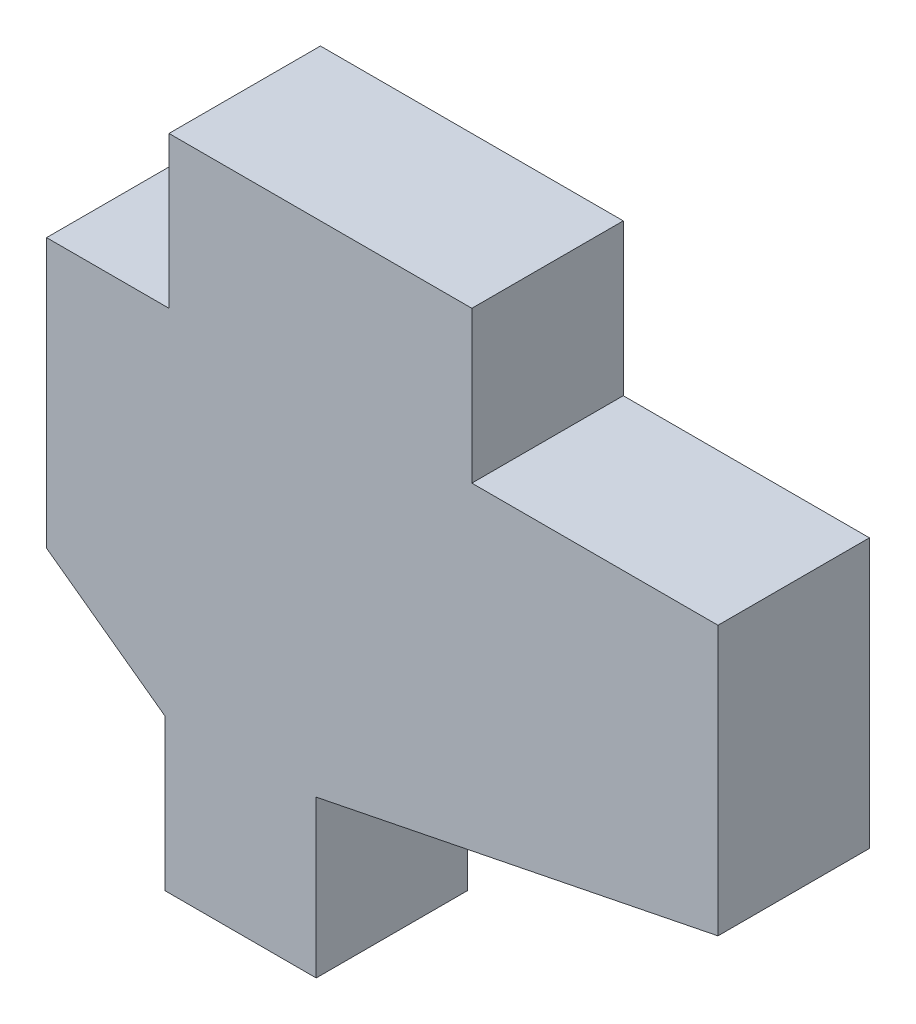
ISO-10303-21;
HEADER;
FILE_DESCRIPTION(('STEP AP214'),'2;1');
FILE_NAME('part.step','',(''),(''),'','','');
FILE_SCHEMA(('AUTOMOTIVE_DESIGN { 1 0 10303 214 1 1 1 1 }'));
ENDSEC;
DATA;
#1=APPLICATION_CONTEXT('core data for automotive mechanical design processes');
#2=APPLICATION_PROTOCOL_DEFINITION('international standard','automotive_design',2000,#1);
#3=PRODUCT_CONTEXT('',#1,'mechanical');
#4=PRODUCT('Part','Part','',(#3));
#5=PRODUCT_RELATED_PRODUCT_CATEGORY('part','',(#4));
#6=PRODUCT_DEFINITION_FORMATION('','',#4);
#7=PRODUCT_DEFINITION_CONTEXT('part definition',#1,'design');
#8=PRODUCT_DEFINITION('design','',#6,#7);
#9=PRODUCT_DEFINITION_SHAPE('','',#8);
#10=(LENGTH_UNIT() NAMED_UNIT(*) SI_UNIT(.MILLI.,.METRE.));
#11=(NAMED_UNIT(*) PLANE_ANGLE_UNIT() SI_UNIT($,.RADIAN.));
#12=(NAMED_UNIT(*) SI_UNIT($,.STERADIAN.) SOLID_ANGLE_UNIT());
#13=UNCERTAINTY_MEASURE_WITH_UNIT(LENGTH_MEASURE(1.E-05),#10,'distance_accuracy_value','');
#14=(GEOMETRIC_REPRESENTATION_CONTEXT(3) GLOBAL_UNCERTAINTY_ASSIGNED_CONTEXT((#13)) GLOBAL_UNIT_ASSIGNED_CONTEXT((#10,
#11,#12)) REPRESENTATION_CONTEXT('',''));
#15=CARTESIAN_POINT('',(0.,0.,0.));
#16=DIRECTION('',(0.,0.,1.));
#17=DIRECTION('',(1.,0.,0.));
#18=AXIS2_PLACEMENT_3D('',#15,#16,#17);
#19=CARTESIAN_POINT('',(-75.1467412259888,-1.524,1.524));
#20=DIRECTION('',(0.,-1.,0.));
#21=DIRECTION('',(0.,0.,-1.));
#22=AXIS2_PLACEMENT_3D('',#19,#20,#21);
#23=PLANE('',#22);
#24=DIRECTION('',(-1.,0.,0.));
#25=VECTOR('',#24,1.);
#26=CARTESIAN_POINT('',(-75.1467412259888,-1.524,0.));
#27=LINE('',#26,#25);
#28=CARTESIAN_POINT('',(-75.1467412259888,-1.524,0.));
#29=VERTEX_POINT('',#28);
#30=CARTESIAN_POINT('',(-76.378564210632,-1.524,0.));
#31=VERTEX_POINT('',#30);
#32=EDGE_CURVE('E152',#29,#31,#27,.T.);
#33=ORIENTED_EDGE('',*,*,#32,.T.);
#34=DIRECTION('',(0.,0.,-1.));
#35=VECTOR('',#34,1.);
#36=CARTESIAN_POINT('',(-76.378564210632,-1.524,1.524));
#37=LINE('',#36,#35);
#38=CARTESIAN_POINT('',(-76.378564210632,-1.524,1.524));
#39=VERTEX_POINT('',#38);
#40=EDGE_CURVE('E11',#39,#31,#37,.T.);
#41=ORIENTED_EDGE('',*,*,#40,.F.);
#42=DIRECTION('',(-1.,0.,0.));
#43=VECTOR('',#42,1.);
#44=CARTESIAN_POINT('',(-75.1467412259888,-1.524,1.524));
#45=LINE('',#44,#43);
#46=CARTESIAN_POINT('',(-75.1467412259888,-1.524,1.524));
#47=VERTEX_POINT('',#46);
#48=EDGE_CURVE('E174',#47,#39,#45,.T.);
#49=ORIENTED_EDGE('',*,*,#48,.F.);
#50=DIRECTION('',(0.,0.,-1.));
#51=VECTOR('',#50,1.);
#52=CARTESIAN_POINT('',(-75.1467412259888,-1.524,1.524));
#53=LINE('',#52,#51);
#54=EDGE_CURVE('E148',#47,#29,#53,.T.);
#55=ORIENTED_EDGE('',*,*,#54,.T.);
#56=EDGE_LOOP('',(#33,#41,#49,#55));
#57=FACE_BOUND('',#56,.T.);
#58=ADVANCED_FACE('F32',(#57),#23,.F.);
#59=CARTESIAN_POINT('',(-76.378564210632,-1.524,1.524));
#60=DIRECTION('',(1.,0.,0.));
#61=DIRECTION('',(0.,0.,-1.));
#62=AXIS2_PLACEMENT_3D('',#59,#60,#61);
#63=PLANE('',#62);
#64=DIRECTION('',(0.,-1.,0.));
#65=VECTOR('',#64,1.);
#66=CARTESIAN_POINT('',(-76.378564210632,-1.524,0.));
#67=LINE('',#66,#65);
#68=CARTESIAN_POINT('',(-76.378564210632,-4.23137284195718,0.));
#69=VERTEX_POINT('',#68);
#70=EDGE_CURVE('E155',#31,#69,#67,.T.);
#71=ORIENTED_EDGE('',*,*,#70,.T.);
#72=DIRECTION('',(0.,0.,-1.));
#73=VECTOR('',#72,1.);
#74=CARTESIAN_POINT('',(-76.378564210632,-4.23137284195718,1.524));
#75=LINE('',#74,#73);
#76=CARTESIAN_POINT('',(-76.378564210632,-4.23137284195718,1.524));
#77=VERTEX_POINT('',#76);
#78=EDGE_CURVE('E40',#77,#69,#75,.T.);
#79=ORIENTED_EDGE('',*,*,#78,.F.);
#80=DIRECTION('',(0.,-1.,0.));
#81=VECTOR('',#80,1.);
#82=CARTESIAN_POINT('',(-76.378564210632,-1.524,1.524));
#83=LINE('',#82,#81);
#84=EDGE_CURVE('E103',#39,#77,#83,.T.);
#85=ORIENTED_EDGE('',*,*,#84,.F.);
#86=ORIENTED_EDGE('',*,*,#40,.T.);
#87=EDGE_LOOP('',(#71,#79,#85,#86));
#88=FACE_BOUND('',#87,.T.);
#89=ADVANCED_FACE('F252',(#88),#63,.F.);
#90=CARTESIAN_POINT('',(-76.378564210632,-4.23137284195718,1.524));
#91=DIRECTION('',(0.588188005844227,0.808724223565111,0.));
#92=DIRECTION('',(-0.808724223565111,0.588188005844227,0.));
#93=AXIS2_PLACEMENT_3D('',#90,#91,#92);
#94=PLANE('',#93);
#95=DIRECTION('',(0.808724223565111,-0.588188005844227,0.));
#96=VECTOR('',#95,1.);
#97=CARTESIAN_POINT('',(-76.378564210632,-4.23137284195718,0.));
#98=LINE('',#97,#96);
#99=CARTESIAN_POINT('',(-75.1892370237555,-5.09637473748769,0.));
#100=VERTEX_POINT('',#99);
#101=EDGE_CURVE('E157',#69,#100,#98,.T.);
#102=ORIENTED_EDGE('',*,*,#101,.T.);
#103=DIRECTION('',(0.,0.,-1.));
#104=VECTOR('',#103,1.);
#105=CARTESIAN_POINT('',(-75.1892370237555,-5.09637473748769,1.524));
#106=LINE('',#105,#104);
#107=CARTESIAN_POINT('',(-75.1892370237555,-5.09637473748769,1.524));
#108=VERTEX_POINT('',#107);
#109=EDGE_CURVE('E193',#108,#100,#106,.T.);
#110=ORIENTED_EDGE('',*,*,#109,.F.);
#111=DIRECTION('',(0.808724223565111,-0.588188005844227,0.));
#112=VECTOR('',#111,1.);
#113=CARTESIAN_POINT('',(-76.378564210632,-4.23137284195718,1.524));
#114=LINE('',#113,#112);
#115=EDGE_CURVE('E201',#77,#108,#114,.T.);
#116=ORIENTED_EDGE('',*,*,#115,.F.);
#117=ORIENTED_EDGE('',*,*,#78,.T.);
#118=EDGE_LOOP('',(#102,#110,#116,#117));
#119=FACE_BOUND('',#118,.T.);
#120=ADVANCED_FACE('F199',(#119),#94,.F.);
#121=CARTESIAN_POINT('',(-75.1892370237555,-5.09637473748769,1.524));
#122=DIRECTION('',(1.,0.,0.));
#123=DIRECTION('',(0.,0.,-1.));
#124=AXIS2_PLACEMENT_3D('',#121,#122,#123);
#125=PLANE('',#124);
#126=DIRECTION('',(0.,-1.,0.));
#127=VECTOR('',#126,1.);
#128=CARTESIAN_POINT('',(-75.1892370237555,-5.09637473748769,0.));
#129=LINE('',#128,#127);
#130=CARTESIAN_POINT('',(-75.1892370237555,-6.62037473748769,0.));
#131=VERTEX_POINT('',#130);
#132=EDGE_CURVE('E159',#100,#131,#129,.T.);
#133=ORIENTED_EDGE('',*,*,#132,.T.);
#134=DIRECTION('',(0.,0.,-1.));
#135=VECTOR('',#134,1.);
#136=CARTESIAN_POINT('',(-75.1892370237555,-6.62037473748769,1.524));
#137=LINE('',#136,#135);
#138=CARTESIAN_POINT('',(-75.1892370237555,-6.62037473748769,1.524));
#139=VERTEX_POINT('',#138);
#140=EDGE_CURVE('E190',#139,#131,#137,.T.);
#141=ORIENTED_EDGE('',*,*,#140,.F.);
#142=DIRECTION('',(0.,-1.,0.));
#143=VECTOR('',#142,1.);
#144=CARTESIAN_POINT('',(-75.1892370237555,-5.09637473748769,1.524));
#145=LINE('',#144,#143);
#146=EDGE_CURVE('E219',#108,#139,#145,.T.);
#147=ORIENTED_EDGE('',*,*,#146,.F.);
#148=ORIENTED_EDGE('',*,*,#109,.T.);
#149=EDGE_LOOP('',(#133,#141,#147,#148));
#150=FACE_BOUND('',#149,.T.);
#151=ADVANCED_FACE('F210',(#150),#125,.F.);
#152=CARTESIAN_POINT('',(-75.1892370237555,-6.62037473748769,1.524));
#153=DIRECTION('',(0.,1.,0.));
#154=DIRECTION('',(0.,0.,1.));
#155=AXIS2_PLACEMENT_3D('',#152,#153,#154);
#156=PLANE('',#155);
#157=DIRECTION('',(1.,0.,0.));
#158=VECTOR('',#157,1.);
#159=CARTESIAN_POINT('',(-75.1892370237555,-6.62037473748769,0.));
#160=LINE('',#159,#158);
#161=CARTESIAN_POINT('',(-73.6652370237555,-6.62037473748769,0.));
#162=VERTEX_POINT('',#161);
#163=EDGE_CURVE('E161',#131,#162,#160,.T.);
#164=ORIENTED_EDGE('',*,*,#163,.T.);
#165=DIRECTION('',(0.,0.,-1.));
#166=VECTOR('',#165,1.);
#167=CARTESIAN_POINT('',(-73.6652370237555,-6.62037473748769,1.524));
#168=LINE('',#167,#166);
#169=CARTESIAN_POINT('',(-73.6652370237555,-6.62037473748769,1.524));
#170=VERTEX_POINT('',#169);
#171=EDGE_CURVE('E187',#170,#162,#168,.T.);
#172=ORIENTED_EDGE('',*,*,#171,.F.);
#173=DIRECTION('',(1.,0.,0.));
#174=VECTOR('',#173,1.);
#175=CARTESIAN_POINT('',(-75.1892370237555,-6.62037473748769,1.524));
#176=LINE('',#175,#174);
#177=EDGE_CURVE('E216',#139,#170,#176,.T.);
#178=ORIENTED_EDGE('',*,*,#177,.F.);
#179=ORIENTED_EDGE('',*,*,#140,.T.);
#180=EDGE_LOOP('',(#164,#172,#178,#179));
#181=FACE_BOUND('',#180,.T.);
#182=ADVANCED_FACE('F214',(#181),#156,.F.);
#183=CARTESIAN_POINT('',(-73.6652370237555,-6.62037473748769,1.524));
#184=DIRECTION('',(-1.,0.,0.));
#185=DIRECTION('',(0.,0.,1.));
#186=AXIS2_PLACEMENT_3D('',#183,#184,#185);
#187=PLANE('',#186);
#188=DIRECTION('',(0.,1.,0.));
#189=VECTOR('',#188,1.);
#190=CARTESIAN_POINT('',(-73.6652370237555,-6.62037473748769,0.));
#191=LINE('',#190,#189);
#192=CARTESIAN_POINT('',(-73.6652370237555,-5.04370517092576,0.));
#193=VERTEX_POINT('',#192);
#194=EDGE_CURVE('E163',#162,#193,#191,.T.);
#195=ORIENTED_EDGE('',*,*,#194,.T.);
#196=DIRECTION('',(0.,0.,-1.));
#197=VECTOR('',#196,1.);
#198=CARTESIAN_POINT('',(-73.6652370237555,-5.04370517092576,1.524));
#199=LINE('',#198,#197);
#200=CARTESIAN_POINT('',(-73.6652370237555,-5.04370517092576,1.524));
#201=VERTEX_POINT('',#200);
#202=EDGE_CURVE('E184',#201,#193,#199,.T.);
#203=ORIENTED_EDGE('',*,*,#202,.F.);
#204=DIRECTION('',(0.,1.,0.));
#205=VECTOR('',#204,1.);
#206=CARTESIAN_POINT('',(-73.6652370237555,-6.62037473748769,1.524));
#207=LINE('',#206,#205);
#208=EDGE_CURVE('E218',#170,#201,#207,.T.);
#209=ORIENTED_EDGE('',*,*,#208,.F.);
#210=ORIENTED_EDGE('',*,*,#171,.T.);
#211=EDGE_LOOP('',(#195,#203,#209,#210));
#212=FACE_BOUND('',#211,.T.);
#213=ADVANCED_FACE('F265',(#212),#187,.F.);
#214=CARTESIAN_POINT('',(-73.6652370237555,-5.04370517092576,1.524));
#215=DIRECTION('',(-0.196949830422033,0.980413567988903,0.));
#216=DIRECTION('',(-0.980413567988904,-0.196949830422033,0.));
#217=AXIS2_PLACEMENT_3D('',#214,#215,#216);
#218=PLANE('',#217);
#219=DIRECTION('',(0.980413567988904,0.196949830422033,0.));
#220=VECTOR('',#219,1.);
#221=CARTESIAN_POINT('',(-73.6652370237555,-5.04370517092576,0.));
#222=LINE('',#221,#220);
#223=CARTESIAN_POINT('',(-69.6214577763694,-4.23137284195718,0.));
#224=VERTEX_POINT('',#223);
#225=EDGE_CURVE('E165',#193,#224,#222,.T.);
#226=ORIENTED_EDGE('',*,*,#225,.T.);
#227=DIRECTION('',(0.,0.,-1.));
#228=VECTOR('',#227,1.);
#229=CARTESIAN_POINT('',(-69.6214577763694,-4.23137284195718,1.524));
#230=LINE('',#229,#228);
#231=CARTESIAN_POINT('',(-69.6214577763694,-4.23137284195718,1.524));
#232=VERTEX_POINT('',#231);
#233=EDGE_CURVE('E181',#232,#224,#230,.T.);
#234=ORIENTED_EDGE('',*,*,#233,.F.);
#235=DIRECTION('',(0.980413567988904,0.196949830422033,0.));
#236=VECTOR('',#235,1.);
#237=CARTESIAN_POINT('',(-73.6652370237555,-5.04370517092576,1.524));
#238=LINE('',#237,#236);
#239=EDGE_CURVE('E221',#201,#232,#238,.T.);
#240=ORIENTED_EDGE('',*,*,#239,.F.);
#241=ORIENTED_EDGE('',*,*,#202,.T.);
#242=EDGE_LOOP('',(#226,#234,#240,#241));
#243=FACE_BOUND('',#242,.T.);
#244=ADVANCED_FACE('F268',(#243),#218,.F.);
#245=CARTESIAN_POINT('',(-69.6214577763694,-1.524,1.524));
#246=DIRECTION('',(-1.,0.,0.));
#247=DIRECTION('',(0.,0.,1.));
#248=AXIS2_PLACEMENT_3D('',#245,#246,#247);
#249=PLANE('',#248);
#250=DIRECTION('',(0.,1.,0.));
#251=VECTOR('',#250,1.);
#252=CARTESIAN_POINT('',(-69.6214577763694,-1.524,0.));
#253=LINE('',#252,#251);
#254=CARTESIAN_POINT('',(-69.6214577763694,-1.524,0.));
#255=VERTEX_POINT('',#254);
#256=EDGE_CURVE('E167',#224,#255,#253,.T.);
#257=ORIENTED_EDGE('',*,*,#256,.T.);
#258=DIRECTION('',(0.,0.,-1.));
#259=VECTOR('',#258,1.);
#260=CARTESIAN_POINT('',(-69.6214577763694,-1.524,1.524));
#261=LINE('',#260,#259);
#262=CARTESIAN_POINT('',(-69.6214577763694,-1.524,1.524));
#263=VERTEX_POINT('',#262);
#264=EDGE_CURVE('E178',#263,#255,#261,.T.);
#265=ORIENTED_EDGE('',*,*,#264,.F.);
#266=DIRECTION('',(0.,1.,0.));
#267=VECTOR('',#266,1.);
#268=CARTESIAN_POINT('',(-69.6214577763694,-1.524,1.524));
#269=LINE('',#268,#267);
#270=EDGE_CURVE('E227',#232,#263,#269,.T.);
#271=ORIENTED_EDGE('',*,*,#270,.F.);
#272=ORIENTED_EDGE('',*,*,#233,.T.);
#273=EDGE_LOOP('',(#257,#265,#271,#272));
#274=FACE_BOUND('',#273,.T.);
#275=ADVANCED_FACE('F233',(#274),#249,.F.);
#276=CARTESIAN_POINT('',(-72.0987412259888,-1.524,1.524));
#277=DIRECTION('',(0.,-1.,0.));
#278=DIRECTION('',(0.,0.,-1.));
#279=AXIS2_PLACEMENT_3D('',#276,#277,#278);
#280=PLANE('',#279);
#281=DIRECTION('',(-1.,0.,0.));
#282=VECTOR('',#281,1.);
#283=CARTESIAN_POINT('',(-72.0987412259888,-1.524,0.));
#284=LINE('',#283,#282);
#285=CARTESIAN_POINT('',(-72.0987412259888,-1.524,0.));
#286=VERTEX_POINT('',#285);
#287=EDGE_CURVE('E169',#255,#286,#284,.T.);
#288=ORIENTED_EDGE('',*,*,#287,.T.);
#289=DIRECTION('',(0.,0.,-1.));
#290=VECTOR('',#289,1.);
#291=CARTESIAN_POINT('',(-72.0987412259888,-1.524,1.524));
#292=LINE('',#291,#290);
#293=CARTESIAN_POINT('',(-72.0987412259888,-1.524,1.524));
#294=VERTEX_POINT('',#293);
#295=EDGE_CURVE('E143',#294,#286,#292,.T.);
#296=ORIENTED_EDGE('',*,*,#295,.F.);
#297=DIRECTION('',(-1.,0.,0.));
#298=VECTOR('',#297,1.);
#299=CARTESIAN_POINT('',(-72.0987412259888,-1.524,1.524));
#300=LINE('',#299,#298);
#301=EDGE_CURVE('E134',#263,#294,#300,.T.);
#302=ORIENTED_EDGE('',*,*,#301,.F.);
#303=ORIENTED_EDGE('',*,*,#264,.T.);
#304=EDGE_LOOP('',(#288,#296,#302,#303));
#305=FACE_BOUND('',#304,.T.);
#306=ADVANCED_FACE('F237',(#305),#280,.F.);
#307=CARTESIAN_POINT('',(-72.0987412259888,0.,1.524));
#308=DIRECTION('',(-1.,0.,0.));
#309=DIRECTION('',(0.,0.,1.));
#310=AXIS2_PLACEMENT_3D('',#307,#308,#309);
#311=PLANE('',#310);
#312=DIRECTION('',(0.,1.,0.));
#313=VECTOR('',#312,1.);
#314=CARTESIAN_POINT('',(-72.0987412259888,0.,0.));
#315=LINE('',#314,#313);
#316=CARTESIAN_POINT('',(-72.0987412259888,0.,0.));
#317=VERTEX_POINT('',#316);
#318=EDGE_CURVE('E142',#286,#317,#315,.T.);
#319=ORIENTED_EDGE('',*,*,#318,.T.);
#320=DIRECTION('',(0.,0.,-1.));
#321=VECTOR('',#320,1.);
#322=CARTESIAN_POINT('',(-72.0987412259888,0.,1.524));
#323=LINE('',#322,#321);
#324=CARTESIAN_POINT('',(-72.0987412259888,0.,1.524));
#325=VERTEX_POINT('',#324);
#326=EDGE_CURVE('E139',#325,#317,#323,.T.);
#327=ORIENTED_EDGE('',*,*,#326,.F.);
#328=DIRECTION('',(0.,1.,0.));
#329=VECTOR('',#328,1.);
#330=CARTESIAN_POINT('',(-72.0987412259888,0.,1.524));
#331=LINE('',#330,#329);
#332=EDGE_CURVE('E128',#294,#325,#331,.T.);
#333=ORIENTED_EDGE('',*,*,#332,.F.);
#334=ORIENTED_EDGE('',*,*,#295,.T.);
#335=EDGE_LOOP('',(#319,#327,#333,#334));
#336=FACE_BOUND('',#335,.T.);
#337=ADVANCED_FACE('F140',(#336),#311,.F.);
#338=CARTESIAN_POINT('',(-75.1467412259888,0.,1.524));
#339=DIRECTION('',(0.,-1.,0.));
#340=DIRECTION('',(0.,0.,-1.));
#341=AXIS2_PLACEMENT_3D('',#338,#339,#340);
#342=PLANE('',#341);
#343=DIRECTION('',(-1.,0.,0.));
#344=VECTOR('',#343,1.);
#345=CARTESIAN_POINT('',(-75.1467412259888,0.,0.));
#346=LINE('',#345,#344);
#347=CARTESIAN_POINT('',(-75.1467412259888,0.,0.));
#348=VERTEX_POINT('',#347);
#349=EDGE_CURVE('E89',#317,#348,#346,.T.);
#350=ORIENTED_EDGE('',*,*,#349,.T.);
#351=DIRECTION('',(0.,0.,-1.));
#352=VECTOR('',#351,1.);
#353=CARTESIAN_POINT('',(-75.1467412259888,0.,1.524));
#354=LINE('',#353,#352);
#355=CARTESIAN_POINT('',(-75.1467412259888,0.,1.524));
#356=VERTEX_POINT('',#355);
#357=EDGE_CURVE('E144',#356,#348,#354,.T.);
#358=ORIENTED_EDGE('',*,*,#357,.F.);
#359=DIRECTION('',(-1.,0.,0.));
#360=VECTOR('',#359,1.);
#361=CARTESIAN_POINT('',(-75.1467412259888,0.,1.524));
#362=LINE('',#361,#360);
#363=EDGE_CURVE('E132',#325,#356,#362,.T.);
#364=ORIENTED_EDGE('',*,*,#363,.F.);
#365=ORIENTED_EDGE('',*,*,#326,.T.);
#366=EDGE_LOOP('',(#350,#358,#364,#365));
#367=FACE_BOUND('',#366,.T.);
#368=ADVANCED_FACE('F146',(#367),#342,.F.);
#369=CARTESIAN_POINT('',(-75.1467412259888,-1.524,1.524));
#370=DIRECTION('',(1.,0.,0.));
#371=DIRECTION('',(0.,0.,-1.));
#372=AXIS2_PLACEMENT_3D('',#369,#370,#371);
#373=PLANE('',#372);
#374=DIRECTION('',(0.,-1.,0.));
#375=VECTOR('',#374,1.);
#376=CARTESIAN_POINT('',(-75.1467412259888,-1.524,0.));
#377=LINE('',#376,#375);
#378=EDGE_CURVE('E95',#348,#29,#377,.T.);
#379=ORIENTED_EDGE('',*,*,#378,.T.);
#380=ORIENTED_EDGE('',*,*,#54,.F.);
#381=DIRECTION('',(0.,-1.,0.));
#382=VECTOR('',#381,1.);
#383=CARTESIAN_POINT('',(-75.1467412259888,-1.524,1.524));
#384=LINE('',#383,#382);
#385=EDGE_CURVE('E48',#356,#47,#384,.T.);
#386=ORIENTED_EDGE('',*,*,#385,.F.);
#387=ORIENTED_EDGE('',*,*,#357,.T.);
#388=EDGE_LOOP('',(#379,#380,#386,#387));
#389=FACE_BOUND('',#388,.T.);
#390=ADVANCED_FACE('F241',(#389),#373,.F.);
#391=CARTESIAN_POINT('',(0.,0.,1.524));
#392=DIRECTION('',(0.,0.,1.));
#393=DIRECTION('',(1.,0.,0.));
#394=AXIS2_PLACEMENT_3D('',#391,#392,#393);
#395=PLANE('',#394);
#396=ORIENTED_EDGE('',*,*,#48,.T.);
#397=ORIENTED_EDGE('',*,*,#84,.T.);
#398=ORIENTED_EDGE('',*,*,#115,.T.);
#399=ORIENTED_EDGE('',*,*,#146,.T.);
#400=ORIENTED_EDGE('',*,*,#177,.T.);
#401=ORIENTED_EDGE('',*,*,#208,.T.);
#402=ORIENTED_EDGE('',*,*,#239,.T.);
#403=ORIENTED_EDGE('',*,*,#270,.T.);
#404=ORIENTED_EDGE('',*,*,#301,.T.);
#405=ORIENTED_EDGE('',*,*,#332,.T.);
#406=ORIENTED_EDGE('',*,*,#363,.T.);
#407=ORIENTED_EDGE('',*,*,#385,.T.);
#408=EDGE_LOOP('',(#396,#397,#398,#399,#400,#401,#402,#403,#404,#405,#406,#407));
#409=FACE_BOUND('',#408,.T.);
#410=ADVANCED_FACE('F130',(#409),#395,.T.);
#411=CARTESIAN_POINT('',(0.,0.,0.));
#412=DIRECTION('',(0.,0.,1.));
#413=DIRECTION('',(1.,0.,0.));
#414=AXIS2_PLACEMENT_3D('',#411,#412,#413);
#415=PLANE('',#414);
#416=ORIENTED_EDGE('',*,*,#32,.F.);
#417=ORIENTED_EDGE('',*,*,#378,.F.);
#418=ORIENTED_EDGE('',*,*,#349,.F.);
#419=ORIENTED_EDGE('',*,*,#318,.F.);
#420=ORIENTED_EDGE('',*,*,#287,.F.);
#421=ORIENTED_EDGE('',*,*,#256,.F.);
#422=ORIENTED_EDGE('',*,*,#225,.F.);
#423=ORIENTED_EDGE('',*,*,#194,.F.);
#424=ORIENTED_EDGE('',*,*,#163,.F.);
#425=ORIENTED_EDGE('',*,*,#132,.F.);
#426=ORIENTED_EDGE('',*,*,#101,.F.);
#427=ORIENTED_EDGE('',*,*,#70,.F.);
#428=EDGE_LOOP('',(#416,#417,#418,#419,#420,#421,#422,#423,#424,#425,#426,#427));
#429=FACE_BOUND('',#428,.T.);
#430=ADVANCED_FACE('F205',(#429),#415,.F.);
#431=CLOSED_SHELL('',(#58,#89,#120,#151,#182,#213,#244,#275,#306,#337,#368,#390,#410,#430));
#432=MANIFOLD_SOLID_BREP('B2',#431);
#433=ADVANCED_BREP_SHAPE_REPRESENTATION('',(#18,#432),#14);
#434=SHAPE_DEFINITION_REPRESENTATION(#9,#433);
ENDSEC;
END-ISO-10303-21;
